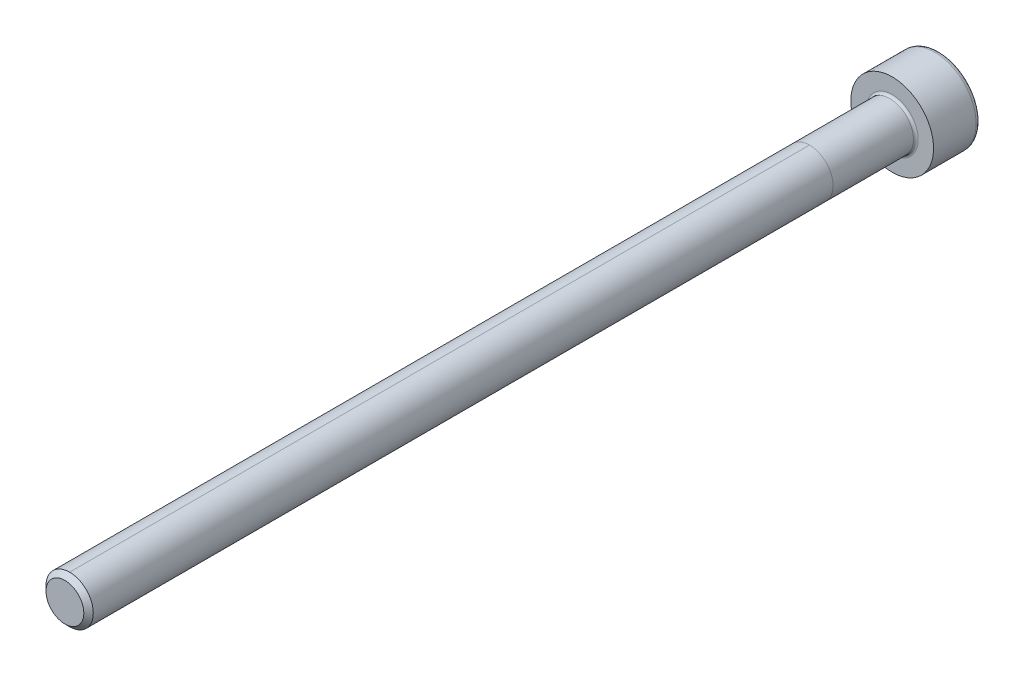
ISO-10303-21;
HEADER;
FILE_DESCRIPTION(('STEP AP214'),'2;1');
FILE_NAME('part.step','',(''),(''),'','','');
FILE_SCHEMA(('AUTOMOTIVE_DESIGN { 1 0 10303 214 1 1 1 1 }'));
ENDSEC;
DATA;
#1=APPLICATION_CONTEXT('core data for automotive mechanical design processes');
#2=APPLICATION_PROTOCOL_DEFINITION('international standard','automotive_design',2000,#1);
#3=PRODUCT_CONTEXT('',#1,'mechanical');
#4=PRODUCT('Part','Part','',(#3));
#5=PRODUCT_RELATED_PRODUCT_CATEGORY('part','',(#4));
#6=PRODUCT_DEFINITION_FORMATION('','',#4);
#7=PRODUCT_DEFINITION_CONTEXT('part definition',#1,'design');
#8=PRODUCT_DEFINITION('design','',#6,#7);
#9=PRODUCT_DEFINITION_SHAPE('','',#8);
#10=(LENGTH_UNIT() NAMED_UNIT(*) SI_UNIT(.MILLI.,.METRE.));
#11=(NAMED_UNIT(*) PLANE_ANGLE_UNIT() SI_UNIT($,.RADIAN.));
#12=(NAMED_UNIT(*) SI_UNIT($,.STERADIAN.) SOLID_ANGLE_UNIT());
#13=UNCERTAINTY_MEASURE_WITH_UNIT(LENGTH_MEASURE(1.E-05),#10,'distance_accuracy_value','');
#14=(GEOMETRIC_REPRESENTATION_CONTEXT(3) GLOBAL_UNCERTAINTY_ASSIGNED_CONTEXT((#13)) GLOBAL_UNIT_ASSIGNED_CONTEXT((#10,
#11,#12)) REPRESENTATION_CONTEXT('',''));
#15=CARTESIAN_POINT('',(0.,0.,0.));
#16=DIRECTION('',(0.,0.,1.));
#17=DIRECTION('',(1.,0.,0.));
#18=AXIS2_PLACEMENT_3D('',#15,#16,#17);
#19=CARTESIAN_POINT('',(0.,0.,70.));
#20=DIRECTION('',(0.,0.,-1.));
#21=DIRECTION('',(-1.,0.,0.));
#22=AXIS2_PLACEMENT_3D('',#19,#20,#21);
#23=CYLINDRICAL_SURFACE('',#22,2.);
#24=DIRECTION('',(0.,0.,-1.));
#25=VECTOR('',#24,1.);
#26=CARTESIAN_POINT('',(0.,2.,70.));
#27=LINE('',#26,#25);
#28=CARTESIAN_POINT('',(0.,2.,69.6));
#29=VERTEX_POINT('',#28);
#30=CARTESIAN_POINT('',(0.,2.,7.00000000000001));
#31=VERTEX_POINT('',#30);
#32=EDGE_CURVE('E58',#29,#31,#27,.T.);
#33=ORIENTED_EDGE('',*,*,#32,.F.);
#34=CARTESIAN_POINT('',(0.,0.,69.6));
#35=DIRECTION('',(0.,0.,1.));
#36=DIRECTION('',(1.,0.,0.));
#37=AXIS2_PLACEMENT_3D('',#34,#35,#36);
#38=CIRCLE('',#37,2.);
#39=CARTESIAN_POINT('',(0.,-2.,69.6));
#40=VERTEX_POINT('',#39);
#41=EDGE_CURVE('E192',#29,#40,#38,.F.);
#42=ORIENTED_EDGE('',*,*,#41,.T.);
#43=DIRECTION('',(0.,0.,-1.));
#44=VECTOR('',#43,1.);
#45=CARTESIAN_POINT('',(0.,-2.00000000000001,70.));
#46=LINE('',#45,#44);
#47=CARTESIAN_POINT('',(0.,-2.00000000000001,7.00000000000001));
#48=VERTEX_POINT('',#47);
#49=EDGE_CURVE('E195',#40,#48,#46,.T.);
#50=ORIENTED_EDGE('',*,*,#49,.T.);
#51=CARTESIAN_POINT('',(0.,0.,7.00000000000001));
#52=DIRECTION('',(0.,0.,1.));
#53=DIRECTION('',(0.,-1.,0.));
#54=AXIS2_PLACEMENT_3D('',#51,#52,#53);
#55=CIRCLE('',#54,2.);
#56=EDGE_CURVE('E64',#48,#31,#55,.T.);
#57=ORIENTED_EDGE('',*,*,#56,.T.);
#58=EDGE_LOOP('',(#33,#42,#50,#57));
#59=FACE_BOUND('',#58,.T.);
#60=ADVANCED_FACE('F43',(#59),#23,.T.);
#61=CARTESIAN_POINT('',(0.,0.,0.200000000000006));
#62=DIRECTION('',(0.,0.,-1.));
#63=DIRECTION('',(-1.,0.,0.));
#64=AXIS2_PLACEMENT_3D('',#61,#62,#63);
#65=CIRCLE('',#64,2.);
#66=CARTESIAN_POINT('',(-2.,0.,0.200000000000006));
#67=VERTEX_POINT('',#66);
#68=EDGE_CURVE('E12',#67,#67,#65,.F.);
#69=ORIENTED_EDGE('',*,*,#68,.T.);
#70=EDGE_LOOP('',(#69));
#71=FACE_BOUND('',#70,.T.);
#72=ORIENTED_EDGE('',*,*,#56,.F.);
#73=EDGE_CURVE('E217',#31,#48,#55,.T.);
#74=ORIENTED_EDGE('',*,*,#73,.F.);
#75=EDGE_LOOP('',(#72,#74));
#76=FACE_BOUND('',#75,.T.);
#77=ADVANCED_FACE('F235',(#71,#76),#23,.T.);
#78=EDGE_CURVE('E193',#40,#29,#38,.F.);
#79=ORIENTED_EDGE('',*,*,#78,.T.);
#80=ORIENTED_EDGE('',*,*,#32,.T.);
#81=ORIENTED_EDGE('',*,*,#73,.T.);
#82=ORIENTED_EDGE('',*,*,#49,.F.);
#83=EDGE_LOOP('',(#79,#80,#81,#82));
#84=FACE_BOUND('',#83,.T.);
#85=ADVANCED_FACE('F238',(#84),#23,.T.);
#86=CARTESIAN_POINT('',(0.,0.,70.));
#87=DIRECTION('',(0.,0.,1.));
#88=DIRECTION('',(1.,0.,0.));
#89=AXIS2_PLACEMENT_3D('',#86,#87,#88);
#90=PLANE('',#89);
#91=CARTESIAN_POINT('',(0.,0.,70.));
#92=DIRECTION('',(0.,0.,1.));
#93=DIRECTION('',(1.,0.,0.));
#94=AXIS2_PLACEMENT_3D('',#91,#92,#93);
#95=CIRCLE('',#94,1.60000000000001);
#96=CARTESIAN_POINT('',(1.60000000000001,0.,70.));
#97=VERTEX_POINT('',#96);
#98=EDGE_CURVE('E189',#97,#97,#95,.T.);
#99=ORIENTED_EDGE('',*,*,#98,.T.);
#100=EDGE_LOOP('',(#99));
#101=FACE_BOUND('',#100,.T.);
#102=ADVANCED_FACE('F246',(#101),#90,.T.);
#103=CARTESIAN_POINT('',(0.,0.,0.));
#104=DIRECTION('',(0.,0.,-1.));
#105=DIRECTION('',(-1.,0.,0.));
#106=AXIS2_PLACEMENT_3D('',#103,#104,#105);
#107=PLANE('',#106);
#108=CARTESIAN_POINT('',(0.,0.,0.));
#109=DIRECTION('',(0.,0.,-1.));
#110=DIRECTION('',(-1.,0.,0.));
#111=AXIS2_PLACEMENT_3D('',#108,#109,#110);
#112=CIRCLE('',#111,2.2);
#113=CARTESIAN_POINT('',(-2.2,0.,0.));
#114=VERTEX_POINT('',#113);
#115=EDGE_CURVE('E51',#114,#114,#112,.T.);
#116=ORIENTED_EDGE('',*,*,#115,.T.);
#117=EDGE_LOOP('',(#116));
#118=FACE_BOUND('',#117,.T.);
#119=CARTESIAN_POINT('',(0.,0.,0.));
#120=DIRECTION('',(0.,0.,-1.));
#121=DIRECTION('',(-1.,0.,0.));
#122=AXIS2_PLACEMENT_3D('',#119,#120,#121);
#123=CIRCLE('',#122,3.5);
#124=CARTESIAN_POINT('',(-3.5,0.,0.));
#125=VERTEX_POINT('',#124);
#126=EDGE_CURVE('E179',#125,#125,#123,.T.);
#127=ORIENTED_EDGE('',*,*,#126,.F.);
#128=EDGE_LOOP('',(#127));
#129=FACE_BOUND('',#128,.T.);
#130=ADVANCED_FACE('F224',(#118,#129),#107,.F.);
#131=CARTESIAN_POINT('',(0.,0.,-4.));
#132=DIRECTION('',(0.,0.,1.));
#133=DIRECTION('',(1.,0.,0.));
#134=AXIS2_PLACEMENT_3D('',#131,#132,#133);
#135=CYLINDRICAL_SURFACE('',#134,3.5);
#136=CARTESIAN_POINT('',(0.,0.,-3.6));
#137=DIRECTION('',(0.,0.,-1.));
#138=DIRECTION('',(-1.,0.,0.));
#139=AXIS2_PLACEMENT_3D('',#136,#137,#138);
#140=CIRCLE('',#139,3.5);
#141=CARTESIAN_POINT('',(-3.5,0.,-3.6));
#142=VERTEX_POINT('',#141);
#143=EDGE_CURVE('E186',#142,#142,#140,.F.);
#144=ORIENTED_EDGE('',*,*,#143,.T.);
#145=EDGE_LOOP('',(#144));
#146=FACE_BOUND('',#145,.T.);
#147=ORIENTED_EDGE('',*,*,#126,.T.);
#148=EDGE_LOOP('',(#147));
#149=FACE_BOUND('',#148,.T.);
#150=ADVANCED_FACE('F282',(#146,#149),#135,.T.);
#151=CARTESIAN_POINT('',(0.,0.,-4.));
#152=DIRECTION('',(0.,0.,-1.));
#153=DIRECTION('',(-1.,0.,0.));
#154=AXIS2_PLACEMENT_3D('',#151,#152,#153);
#155=PLANE('',#154);
#156=DIRECTION('',(0.499999999999998,-0.866025403784439,0.));
#157=VECTOR('',#156,1.);
#158=CARTESIAN_POINT('',(0.866025403784439,1.5,-4.));
#159=LINE('',#158,#157);
#160=CARTESIAN_POINT('',(0.866025403784439,1.5,-4.));
#161=VERTEX_POINT('',#160);
#162=CARTESIAN_POINT('',(1.73205080756888,0.,-4.));
#163=VERTEX_POINT('',#162);
#164=EDGE_CURVE('E122',#161,#163,#159,.T.);
#165=ORIENTED_EDGE('',*,*,#164,.F.);
#166=DIRECTION('',(1.,0.,0.));
#167=VECTOR('',#166,1.);
#168=CARTESIAN_POINT('',(-0.866025403784446,1.5,-4.));
#169=LINE('',#168,#167);
#170=CARTESIAN_POINT('',(-0.866025403784446,1.5,-4.));
#171=VERTEX_POINT('',#170);
#172=EDGE_CURVE('E176',#171,#161,#169,.T.);
#173=ORIENTED_EDGE('',*,*,#172,.F.);
#174=DIRECTION('',(0.5,0.866025403784439,0.));
#175=VECTOR('',#174,1.);
#176=CARTESIAN_POINT('',(-1.73205080756888,0.,-4.));
#177=LINE('',#176,#175);
#178=CARTESIAN_POINT('',(-1.73205080756888,0.,-4.));
#179=VERTEX_POINT('',#178);
#180=EDGE_CURVE('E173',#179,#171,#177,.T.);
#181=ORIENTED_EDGE('',*,*,#180,.F.);
#182=DIRECTION('',(-0.5,0.866025403784439,0.));
#183=VECTOR('',#182,1.);
#184=CARTESIAN_POINT('',(-0.866025403784443,-1.5,-4.));
#185=LINE('',#184,#183);
#186=CARTESIAN_POINT('',(-0.866025403784443,-1.5,-4.));
#187=VERTEX_POINT('',#186);
#188=EDGE_CURVE('E170',#187,#179,#185,.T.);
#189=ORIENTED_EDGE('',*,*,#188,.F.);
#190=DIRECTION('',(-1.,0.,0.));
#191=VECTOR('',#190,1.);
#192=CARTESIAN_POINT('',(0.866025403784436,-1.5,-4.));
#193=LINE('',#192,#191);
#194=CARTESIAN_POINT('',(0.866025403784436,-1.5,-4.));
#195=VERTEX_POINT('',#194);
#196=EDGE_CURVE('E167',#195,#187,#193,.T.);
#197=ORIENTED_EDGE('',*,*,#196,.F.);
#198=DIRECTION('',(-0.500000000000001,-0.866025403784438,0.));
#199=VECTOR('',#198,1.);
#200=CARTESIAN_POINT('',(1.73205080756888,0.,-4.));
#201=LINE('',#200,#199);
#202=EDGE_CURVE('E164',#163,#195,#201,.T.);
#203=ORIENTED_EDGE('',*,*,#202,.F.);
#204=EDGE_LOOP('',(#165,#173,#181,#189,#197,#203));
#205=FACE_BOUND('',#204,.T.);
#206=CARTESIAN_POINT('',(0.,0.,-4.));
#207=DIRECTION('',(0.,0.,-1.));
#208=DIRECTION('',(-1.,0.,0.));
#209=AXIS2_PLACEMENT_3D('',#206,#207,#208);
#210=CIRCLE('',#209,3.1);
#211=CARTESIAN_POINT('',(-3.1,0.,-4.));
#212=VERTEX_POINT('',#211);
#213=EDGE_CURVE('E182',#212,#212,#210,.T.);
#214=ORIENTED_EDGE('',*,*,#213,.T.);
#215=EDGE_LOOP('',(#214));
#216=FACE_BOUND('',#215,.T.);
#217=ADVANCED_FACE('F277',(#205,#216),#155,.T.);
#218=CARTESIAN_POINT('',(0.,0.,-3.6));
#219=DIRECTION('',(0.,0.,-1.));
#220=DIRECTION('',(-1.,0.,0.));
#221=AXIS2_PLACEMENT_3D('',#218,#219,#220);
#222=TOROIDAL_SURFACE('',#221,3.1,0.4);
#223=ORIENTED_EDGE('',*,*,#143,.F.);
#224=EDGE_LOOP('',(#223));
#225=FACE_BOUND('',#224,.T.);
#226=ORIENTED_EDGE('',*,*,#213,.F.);
#227=EDGE_LOOP('',(#226));
#228=FACE_BOUND('',#227,.T.);
#229=ADVANCED_FACE('F268',(#225,#228),#222,.T.);
#230=CARTESIAN_POINT('',(0.,0.,70.));
#231=DIRECTION('',(0.,0.,-1.));
#232=DIRECTION('',(-1.,0.,0.));
#233=AXIS2_PLACEMENT_3D('',#230,#231,#232);
#234=CONICAL_SURFACE('',#233,1.60000000000001,0.785398163397457);
#235=ORIENTED_EDGE('',*,*,#78,.F.);
#236=ORIENTED_EDGE('',*,*,#41,.F.);
#237=EDGE_LOOP('',(#235,#236));
#238=FACE_BOUND('',#237,.T.);
#239=ORIENTED_EDGE('',*,*,#98,.F.);
#240=EDGE_LOOP('',(#239));
#241=FACE_BOUND('',#240,.T.);
#242=ADVANCED_FACE('F255',(#238,#241),#234,.T.);
#243=CARTESIAN_POINT('',(0.866025403784439,1.5,-2.66666666666667));
#244=DIRECTION('',(0.866025403784439,0.499999999999998,0.));
#245=DIRECTION('',(-0.499999999999999,0.86602540378444,0.));
#246=AXIS2_PLACEMENT_3D('',#243,#244,#245);
#247=PLANE('',#246);
#248=ORIENTED_EDGE('',*,*,#164,.T.);
#249=DIRECTION('',(0.,0.,-1.));
#250=VECTOR('',#249,1.);
#251=CARTESIAN_POINT('',(1.73205080756888,0.,-2.66666666666667));
#252=LINE('',#251,#250);
#253=CARTESIAN_POINT('',(1.73205080756887,0.,-2.66666666666667));
#254=VERTEX_POINT('',#253);
#255=EDGE_CURVE('E200',#254,#163,#252,.T.);
#256=ORIENTED_EDGE('',*,*,#255,.F.);
#257=DIRECTION('',(-0.499999999999998,0.86602540378444,0.));
#258=VECTOR('',#257,1.);
#259=CARTESIAN_POINT('',(1.73205080756887,0.,-2.66666666666667));
#260=LINE('',#259,#258);
#261=CARTESIAN_POINT('',(0.866025403784439,1.5,-2.66666666666667));
#262=VERTEX_POINT('',#261);
#263=EDGE_CURVE('E117',#262,#254,#260,.F.);
#264=ORIENTED_EDGE('',*,*,#263,.F.);
#265=DIRECTION('',(0.,0.,-1.));
#266=VECTOR('',#265,1.);
#267=CARTESIAN_POINT('',(0.866025403784439,1.5,-2.66666666666667));
#268=LINE('',#267,#266);
#269=EDGE_CURVE('E183',#262,#161,#268,.T.);
#270=ORIENTED_EDGE('',*,*,#269,.T.);
#271=EDGE_LOOP('',(#248,#256,#264,#270));
#272=FACE_BOUND('',#271,.T.);
#273=ADVANCED_FACE('F267',(#272),#247,.F.);
#274=CARTESIAN_POINT('',(-0.866025403784446,1.5,-2.66666666666667));
#275=DIRECTION('',(0.,1.,0.));
#276=DIRECTION('',(0.,0.,1.));
#277=AXIS2_PLACEMENT_3D('',#274,#275,#276);
#278=PLANE('',#277);
#279=ORIENTED_EDGE('',*,*,#172,.T.);
#280=ORIENTED_EDGE('',*,*,#269,.F.);
#281=DIRECTION('',(1.,0.,0.));
#282=VECTOR('',#281,1.);
#283=CARTESIAN_POINT('',(0.,1.5,-2.66666666666667));
#284=LINE('',#283,#282);
#285=CARTESIAN_POINT('',(-0.866025403784447,1.5,-2.66666666666667));
#286=VERTEX_POINT('',#285);
#287=EDGE_CURVE('E131',#286,#262,#284,.T.);
#288=ORIENTED_EDGE('',*,*,#287,.F.);
#289=DIRECTION('',(0.,0.,-1.));
#290=VECTOR('',#289,1.);
#291=CARTESIAN_POINT('',(-0.866025403784446,1.5,-2.66666666666667));
#292=LINE('',#291,#290);
#293=EDGE_CURVE('E196',#286,#171,#292,.T.);
#294=ORIENTED_EDGE('',*,*,#293,.T.);
#295=EDGE_LOOP('',(#279,#280,#288,#294));
#296=FACE_BOUND('',#295,.T.);
#297=ADVANCED_FACE('F274',(#296),#278,.F.);
#298=CARTESIAN_POINT('',(-1.73205080756888,0.,-2.66666666666667));
#299=DIRECTION('',(-0.866025403784439,0.5,0.));
#300=DIRECTION('',(-0.5,-0.866025403784439,0.));
#301=AXIS2_PLACEMENT_3D('',#298,#299,#300);
#302=PLANE('',#301);
#303=ORIENTED_EDGE('',*,*,#180,.T.);
#304=ORIENTED_EDGE('',*,*,#293,.F.);
#305=DIRECTION('',(-0.5,-0.866025403784439,0.));
#306=VECTOR('',#305,1.);
#307=CARTESIAN_POINT('',(-0.866025403784447,1.5,-2.66666666666667));
#308=LINE('',#307,#306);
#309=CARTESIAN_POINT('',(-1.73205080756888,0.,-2.66666666666667));
#310=VERTEX_POINT('',#309);
#311=EDGE_CURVE('E139',#310,#286,#308,.F.);
#312=ORIENTED_EDGE('',*,*,#311,.F.);
#313=DIRECTION('',(0.,0.,-1.));
#314=VECTOR('',#313,1.);
#315=CARTESIAN_POINT('',(-1.73205080756888,0.,-2.66666666666667));
#316=LINE('',#315,#314);
#317=EDGE_CURVE('E198',#310,#179,#316,.T.);
#318=ORIENTED_EDGE('',*,*,#317,.T.);
#319=EDGE_LOOP('',(#303,#304,#312,#318));
#320=FACE_BOUND('',#319,.T.);
#321=ADVANCED_FACE('F310',(#320),#302,.F.);
#322=CARTESIAN_POINT('',(-0.866025403784443,-1.5,-2.66666666666667));
#323=DIRECTION('',(-0.866025403784439,-0.5,0.));
#324=DIRECTION('',(0.5,-0.866025403784439,0.));
#325=AXIS2_PLACEMENT_3D('',#322,#323,#324);
#326=PLANE('',#325);
#327=ORIENTED_EDGE('',*,*,#188,.T.);
#328=ORIENTED_EDGE('',*,*,#317,.F.);
#329=DIRECTION('',(0.5,-0.866025403784439,0.));
#330=VECTOR('',#329,1.);
#331=CARTESIAN_POINT('',(-1.73205080756888,0.,-2.66666666666667));
#332=LINE('',#331,#330);
#333=CARTESIAN_POINT('',(-0.866025403784443,-1.5,-2.66666666666667));
#334=VERTEX_POINT('',#333);
#335=EDGE_CURVE('E147',#334,#310,#332,.F.);
#336=ORIENTED_EDGE('',*,*,#335,.F.);
#337=DIRECTION('',(0.,0.,-1.));
#338=VECTOR('',#337,1.);
#339=CARTESIAN_POINT('',(-0.866025403784443,-1.5,-2.66666666666667));
#340=LINE('',#339,#338);
#341=EDGE_CURVE('E205',#334,#187,#340,.T.);
#342=ORIENTED_EDGE('',*,*,#341,.T.);
#343=EDGE_LOOP('',(#327,#328,#336,#342));
#344=FACE_BOUND('',#343,.T.);
#345=ADVANCED_FACE('F306',(#344),#326,.F.);
#346=CARTESIAN_POINT('',(0.866025403784436,-1.5,-2.66666666666667));
#347=DIRECTION('',(0.,-1.,0.));
#348=DIRECTION('',(0.,0.,-1.));
#349=AXIS2_PLACEMENT_3D('',#346,#347,#348);
#350=PLANE('',#349);
#351=ORIENTED_EDGE('',*,*,#196,.T.);
#352=ORIENTED_EDGE('',*,*,#341,.F.);
#353=DIRECTION('',(1.,0.,0.));
#354=VECTOR('',#353,1.);
#355=CARTESIAN_POINT('',(0.,-1.5,-2.66666666666667));
#356=LINE('',#355,#354);
#357=CARTESIAN_POINT('',(0.866025403784436,-1.5,-2.66666666666667));
#358=VERTEX_POINT('',#357);
#359=EDGE_CURVE('E154',#358,#334,#356,.F.);
#360=ORIENTED_EDGE('',*,*,#359,.F.);
#361=DIRECTION('',(0.,0.,-1.));
#362=VECTOR('',#361,1.);
#363=CARTESIAN_POINT('',(0.866025403784436,-1.5,-2.66666666666667));
#364=LINE('',#363,#362);
#365=EDGE_CURVE('E203',#358,#195,#364,.T.);
#366=ORIENTED_EDGE('',*,*,#365,.T.);
#367=EDGE_LOOP('',(#351,#352,#360,#366));
#368=FACE_BOUND('',#367,.T.);
#369=ADVANCED_FACE('F302',(#368),#350,.F.);
#370=CARTESIAN_POINT('',(1.73205080756888,0.,-2.66666666666667));
#371=DIRECTION('',(0.866025403784438,-0.500000000000001,0.));
#372=DIRECTION('',(0.500000000000001,0.866025403784438,0.));
#373=AXIS2_PLACEMENT_3D('',#370,#371,#372);
#374=PLANE('',#373);
#375=ORIENTED_EDGE('',*,*,#202,.T.);
#376=ORIENTED_EDGE('',*,*,#365,.F.);
#377=DIRECTION('',(0.500000000000001,0.866025403784438,0.));
#378=VECTOR('',#377,1.);
#379=CARTESIAN_POINT('',(0.866025403784436,-1.5,-2.66666666666667));
#380=LINE('',#379,#378);
#381=EDGE_CURVE('E159',#254,#358,#380,.F.);
#382=ORIENTED_EDGE('',*,*,#381,.F.);
#383=ORIENTED_EDGE('',*,*,#255,.T.);
#384=EDGE_LOOP('',(#375,#376,#382,#383));
#385=FACE_BOUND('',#384,.T.);
#386=ADVANCED_FACE('F299',(#385),#374,.F.);
#387=CARTESIAN_POINT('',(-0.583171863311223,-0.336694432266549,-1.89390618149934));
#388=DIRECTION('',(0.290126882702444,0.167504833827402,0.942214690279141));
#389=DIRECTION('',(0.955717783517744,0.,-0.294284757111084));
#390=AXIS2_PLACEMENT_3D('',#387,#388,#389);
#391=PLANE('',#390);
#392=DIRECTION('',(-0.477858891758872,-0.827675879374924,0.294284757111084));
#393=VECTOR('',#392,1.);
#394=CARTESIAN_POINT('',(0.866025403784439,1.5,-2.66666666666667));
#395=LINE('',#394,#393);
#396=CARTESIAN_POINT('',(0.,0.,-2.13333333333333));
#397=VERTEX_POINT('',#396);
#398=EDGE_CURVE('E114',#262,#397,#395,.T.);
#399=ORIENTED_EDGE('',*,*,#398,.F.);
#400=ORIENTED_EDGE('',*,*,#263,.T.);
#401=DIRECTION('',(-0.955717783517745,0.,0.294284757111084));
#402=VECTOR('',#401,1.);
#403=CARTESIAN_POINT('',(1.73205080756888,0.,-2.66666666666667));
#404=LINE('',#403,#402);
#405=EDGE_CURVE('E111',#254,#397,#404,.T.);
#406=ORIENTED_EDGE('',*,*,#405,.T.);
#407=EDGE_LOOP('',(#399,#400,#406));
#408=FACE_BOUND('',#407,.T.);
#409=ADVANCED_FACE('F113',(#408),#391,.F.);
#410=CARTESIAN_POINT('',(-0.583171863311223,0.336694432266551,-1.89390618149934));
#411=DIRECTION('',(0.290126882702444,-0.167504833827403,0.94221469027914));
#412=DIRECTION('',(0.955717783517745,0.,-0.294284757111084));
#413=AXIS2_PLACEMENT_3D('',#410,#411,#412);
#414=PLANE('',#413);
#415=ORIENTED_EDGE('',*,*,#405,.F.);
#416=ORIENTED_EDGE('',*,*,#381,.T.);
#417=DIRECTION('',(-0.477858891758872,0.827675879374924,0.294284757111084));
#418=VECTOR('',#417,1.);
#419=CARTESIAN_POINT('',(0.866025403784436,-1.5,-2.66666666666667));
#420=LINE('',#419,#418);
#421=EDGE_CURVE('E152',#358,#397,#420,.T.);
#422=ORIENTED_EDGE('',*,*,#421,.T.);
#423=EDGE_LOOP('',(#415,#416,#422));
#424=FACE_BOUND('',#423,.T.);
#425=ADVANCED_FACE('F157',(#424),#414,.F.);
#426=CARTESIAN_POINT('',(0.,-0.673388864533099,-1.89390618149934));
#427=DIRECTION('',(0.,0.335009667654805,0.942214690279141));
#428=DIRECTION('',(0.,-0.942214690279141,0.335009667654805));
#429=AXIS2_PLACEMENT_3D('',#426,#427,#428);
#430=PLANE('',#429);
#431=DIRECTION('',(0.477858891758875,-0.827675879374922,0.294284757111083));
#432=VECTOR('',#431,1.);
#433=CARTESIAN_POINT('',(-0.866025403784446,1.5,-2.66666666666667));
#434=LINE('',#433,#432);
#435=EDGE_CURVE('E128',#286,#397,#434,.T.);
#436=ORIENTED_EDGE('',*,*,#435,.F.);
#437=ORIENTED_EDGE('',*,*,#287,.T.);
#438=ORIENTED_EDGE('',*,*,#398,.T.);
#439=EDGE_LOOP('',(#436,#437,#438));
#440=FACE_BOUND('',#439,.T.);
#441=ADVANCED_FACE('F127',(#440),#430,.F.);
#442=CARTESIAN_POINT('',(0.58317186331122,-0.336694432266548,-1.89390618149934));
#443=DIRECTION('',(-0.290126882702442,0.167504833827402,0.942214690279141));
#444=DIRECTION('',(0.955717783517745,0.,0.294284757111083));
#445=AXIS2_PLACEMENT_3D('',#442,#443,#444);
#446=PLANE('',#445);
#447=DIRECTION('',(0.955717783517745,0.,0.294284757111083));
#448=VECTOR('',#447,1.);
#449=CARTESIAN_POINT('',(-1.73205080756888,0.,-2.66666666666667));
#450=LINE('',#449,#448);
#451=EDGE_CURVE('E136',#310,#397,#450,.T.);
#452=ORIENTED_EDGE('',*,*,#451,.F.);
#453=ORIENTED_EDGE('',*,*,#311,.T.);
#454=ORIENTED_EDGE('',*,*,#435,.T.);
#455=EDGE_LOOP('',(#452,#453,#454));
#456=FACE_BOUND('',#455,.T.);
#457=ADVANCED_FACE('F135',(#456),#446,.F.);
#458=CARTESIAN_POINT('',(0.583171863311222,0.336694432266549,-1.89390618149934));
#459=DIRECTION('',(-0.290126882702443,-0.167504833827402,0.942214690279141));
#460=DIRECTION('',(0.955717783517745,0.,0.294284757111083));
#461=AXIS2_PLACEMENT_3D('',#458,#459,#460);
#462=PLANE('',#461);
#463=DIRECTION('',(0.477858891758875,0.827675879374922,0.294284757111084));
#464=VECTOR('',#463,1.);
#465=CARTESIAN_POINT('',(-0.866025403784443,-1.5,-2.66666666666667));
#466=LINE('',#465,#464);
#467=EDGE_CURVE('E144',#334,#397,#466,.T.);
#468=ORIENTED_EDGE('',*,*,#467,.F.);
#469=ORIENTED_EDGE('',*,*,#335,.T.);
#470=ORIENTED_EDGE('',*,*,#451,.T.);
#471=EDGE_LOOP('',(#468,#469,#470));
#472=FACE_BOUND('',#471,.T.);
#473=ADVANCED_FACE('F143',(#472),#462,.F.);
#474=CARTESIAN_POINT('',(0.,0.6733888645331,-1.89390618149934));
#475=DIRECTION('',(0.,-0.335009667654806,0.94221469027914));
#476=DIRECTION('',(0.,-0.94221469027914,-0.335009667654806));
#477=AXIS2_PLACEMENT_3D('',#474,#475,#476);
#478=PLANE('',#477);
#479=ORIENTED_EDGE('',*,*,#421,.F.);
#480=ORIENTED_EDGE('',*,*,#359,.T.);
#481=ORIENTED_EDGE('',*,*,#467,.T.);
#482=EDGE_LOOP('',(#479,#480,#481));
#483=FACE_BOUND('',#482,.T.);
#484=ADVANCED_FACE('F151',(#483),#478,.F.);
#485=CARTESIAN_POINT('',(0.,0.,0.200000000000006));
#486=DIRECTION('',(0.,0.,-1.));
#487=DIRECTION('',(-1.,0.,0.));
#488=AXIS2_PLACEMENT_3D('',#485,#486,#487);
#489=TOROIDAL_SURFACE('',#488,2.2,0.2);
#490=ORIENTED_EDGE('',*,*,#68,.F.);
#491=EDGE_LOOP('',(#490));
#492=FACE_BOUND('',#491,.T.);
#493=ORIENTED_EDGE('',*,*,#115,.F.);
#494=EDGE_LOOP('',(#493));
#495=FACE_BOUND('',#494,.T.);
#496=ADVANCED_FACE('F45',(#492,#495),#489,.F.);
#497=CLOSED_SHELL('',(#60,#77,#85,#102,#130,#150,#217,#229,#242,#273,#297,#321,#345,#369,#386,
#409,#425,#441,#457,#473,#484,#496));
#498=MANIFOLD_SOLID_BREP('B2',#497);
#499=ADVANCED_BREP_SHAPE_REPRESENTATION('',(#18,#498),#14);
#500=SHAPE_DEFINITION_REPRESENTATION(#9,#499);
ENDSEC;
END-ISO-10303-21;
